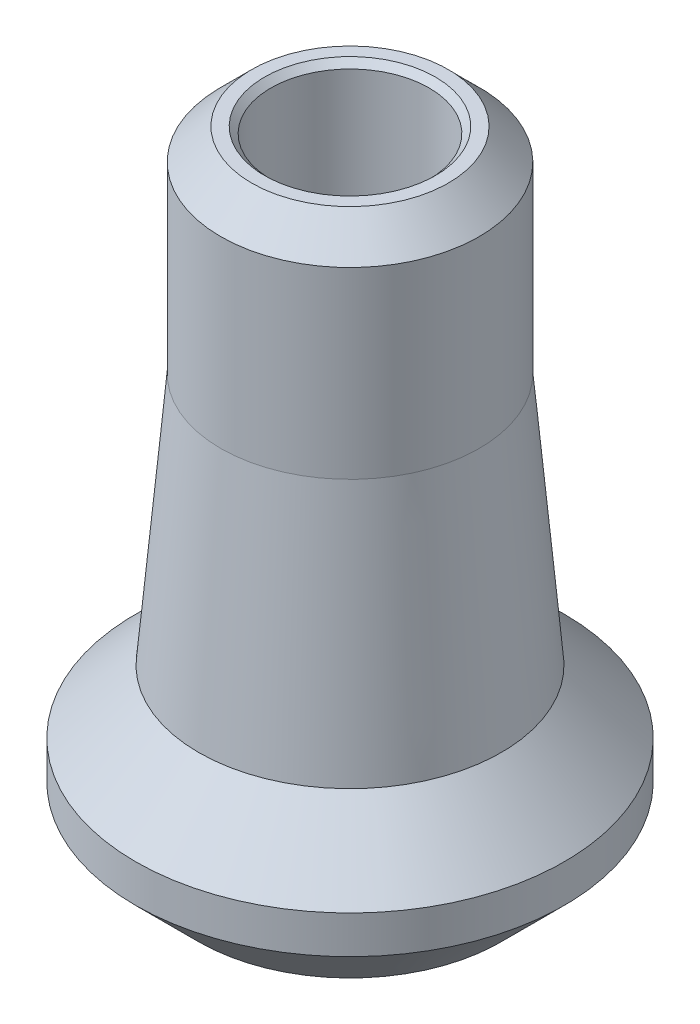
ISO-10303-21;
HEADER;
FILE_DESCRIPTION(('STEP AP214'),'2;1');
FILE_NAME('part.step','',(''),(''),'','','');
FILE_SCHEMA(('AUTOMOTIVE_DESIGN { 1 0 10303 214 1 1 1 1 }'));
ENDSEC;
DATA;
#1=APPLICATION_CONTEXT('core data for automotive mechanical design processes');
#2=APPLICATION_PROTOCOL_DEFINITION('international standard','automotive_design',2000,#1);
#3=PRODUCT_CONTEXT('',#1,'mechanical');
#4=PRODUCT('Part','Part','',(#3));
#5=PRODUCT_RELATED_PRODUCT_CATEGORY('part','',(#4));
#6=PRODUCT_DEFINITION_FORMATION('','',#4);
#7=PRODUCT_DEFINITION_CONTEXT('part definition',#1,'design');
#8=PRODUCT_DEFINITION('design','',#6,#7);
#9=PRODUCT_DEFINITION_SHAPE('','',#8);
#10=(LENGTH_UNIT() NAMED_UNIT(*) SI_UNIT(.MILLI.,.METRE.));
#11=(NAMED_UNIT(*) PLANE_ANGLE_UNIT() SI_UNIT($,.RADIAN.));
#12=(NAMED_UNIT(*) SI_UNIT($,.STERADIAN.) SOLID_ANGLE_UNIT());
#13=UNCERTAINTY_MEASURE_WITH_UNIT(LENGTH_MEASURE(1.E-05),#10,'distance_accuracy_value','');
#14=(GEOMETRIC_REPRESENTATION_CONTEXT(3) GLOBAL_UNCERTAINTY_ASSIGNED_CONTEXT((#13)) GLOBAL_UNIT_ASSIGNED_CONTEXT((#10,
#11,#12)) REPRESENTATION_CONTEXT('',''));
#15=CARTESIAN_POINT('',(0.,0.,0.));
#16=DIRECTION('',(0.,0.,1.));
#17=DIRECTION('',(1.,0.,0.));
#18=AXIS2_PLACEMENT_3D('',#15,#16,#17);
#19=CARTESIAN_POINT('',(0.,0.,0.));
#20=DIRECTION('',(0.,-1.,0.));
#21=DIRECTION('',(0.,0.,-1.));
#22=AXIS2_PLACEMENT_3D('',#19,#20,#21);
#23=CONICAL_SURFACE('',#22,3.9624,0.785398163397446);
#24=CARTESIAN_POINT('',(0.,-1.2446,0.));
#25=DIRECTION('',(0.,1.,0.));
#26=DIRECTION('',(0.,0.,1.));
#27=AXIS2_PLACEMENT_3D('',#24,#25,#26);
#28=CIRCLE('',#27,5.20699999999999);
#29=CARTESIAN_POINT('',(0.,-1.2446,5.20699999999999));
#30=VERTEX_POINT('',#29);
#31=EDGE_CURVE('E51',#30,#30,#28,.T.);
#32=ORIENTED_EDGE('',*,*,#31,.T.);
#33=EDGE_LOOP('',(#32));
#34=FACE_BOUND('',#33,.T.);
#35=CARTESIAN_POINT('',(0.,0.,0.));
#36=DIRECTION('',(0.,1.,0.));
#37=DIRECTION('',(0.,0.,1.));
#38=AXIS2_PLACEMENT_3D('',#35,#36,#37);
#39=CIRCLE('',#38,3.9624);
#40=CARTESIAN_POINT('',(0.,0.,3.9624));
#41=VERTEX_POINT('',#40);
#42=EDGE_CURVE('E69',#41,#41,#39,.T.);
#43=ORIENTED_EDGE('',*,*,#42,.F.);
#44=EDGE_LOOP('',(#43));
#45=FACE_BOUND('',#44,.T.);
#46=ADVANCED_FACE('F32',(#34,#45),#23,.T.);
#47=CARTESIAN_POINT('',(0.,0.,0.));
#48=DIRECTION('',(0.,1.,0.));
#49=DIRECTION('',(0.,0.,1.));
#50=AXIS2_PLACEMENT_3D('',#47,#48,#49);
#51=CYLINDRICAL_SURFACE('',#50,5.207);
#52=CARTESIAN_POINT('',(0.,-8.6346835028455,0.));
#53=DIRECTION('',(0.,1.,0.));
#54=DIRECTION('',(0.,0.,1.));
#55=AXIS2_PLACEMENT_3D('',#52,#53,#54);
#56=CIRCLE('',#55,5.207);
#57=CARTESIAN_POINT('',(0.,-8.6346835028455,5.207));
#58=VERTEX_POINT('',#57);
#59=EDGE_CURVE('E54',#58,#58,#56,.T.);
#60=ORIENTED_EDGE('',*,*,#59,.T.);
#61=EDGE_LOOP('',(#60));
#62=FACE_BOUND('',#61,.T.);
#63=ORIENTED_EDGE('',*,*,#31,.F.);
#64=EDGE_LOOP('',(#63));
#65=FACE_BOUND('',#64,.T.);
#66=ADVANCED_FACE('F76',(#62,#65),#51,.T.);
#67=CARTESIAN_POINT('',(0.,-8.6346835028455,0.));
#68=DIRECTION('',(0.,-1.,0.));
#69=DIRECTION('',(0.,0.,-1.));
#70=AXIS2_PLACEMENT_3D('',#67,#68,#69);
#71=CONICAL_SURFACE('',#70,5.207,0.0872664625997164);
#72=CARTESIAN_POINT('',(0.,-18.796,0.));
#73=DIRECTION('',(0.,1.,0.));
#74=DIRECTION('',(0.,0.,1.));
#75=AXIS2_PLACEMENT_3D('',#72,#73,#74);
#76=CIRCLE('',#75,6.09599999999997);
#77=CARTESIAN_POINT('',(0.,-18.796,6.09599999999997));
#78=VERTEX_POINT('',#77);
#79=EDGE_CURVE('E57',#78,#78,#76,.T.);
#80=ORIENTED_EDGE('',*,*,#79,.T.);
#81=EDGE_LOOP('',(#80));
#82=FACE_BOUND('',#81,.T.);
#83=ORIENTED_EDGE('',*,*,#59,.F.);
#84=EDGE_LOOP('',(#83));
#85=FACE_BOUND('',#84,.T.);
#86=ADVANCED_FACE('F81',(#82,#85),#71,.T.);
#87=CARTESIAN_POINT('',(0.,-18.796,0.));
#88=DIRECTION('',(0.,-1.,0.));
#89=DIRECTION('',(0.,0.,-1.));
#90=AXIS2_PLACEMENT_3D('',#87,#88,#89);
#91=CONICAL_SURFACE('',#90,6.09599999999997,0.785398163397453);
#92=CARTESIAN_POINT('',(0.,-21.336,0.));
#93=DIRECTION('',(0.,1.,0.));
#94=DIRECTION('',(0.,0.,1.));
#95=AXIS2_PLACEMENT_3D('',#92,#93,#94);
#96=CIRCLE('',#95,8.636);
#97=CARTESIAN_POINT('',(0.,-21.336,8.636));
#98=VERTEX_POINT('',#97);
#99=EDGE_CURVE('E60',#98,#98,#96,.T.);
#100=ORIENTED_EDGE('',*,*,#99,.T.);
#101=EDGE_LOOP('',(#100));
#102=FACE_BOUND('',#101,.T.);
#103=ORIENTED_EDGE('',*,*,#79,.F.);
#104=EDGE_LOOP('',(#103));
#105=FACE_BOUND('',#104,.T.);
#106=ADVANCED_FACE('F88',(#102,#105),#91,.T.);
#107=CARTESIAN_POINT('',(0.,0.,0.));
#108=DIRECTION('',(0.,1.,0.));
#109=DIRECTION('',(0.,0.,1.));
#110=AXIS2_PLACEMENT_3D('',#107,#108,#109);
#111=CYLINDRICAL_SURFACE('',#110,8.636);
#112=CARTESIAN_POINT('',(0.,-22.86,0.));
#113=DIRECTION('',(0.,1.,0.));
#114=DIRECTION('',(0.,0.,1.));
#115=AXIS2_PLACEMENT_3D('',#112,#113,#114);
#116=CIRCLE('',#115,8.636);
#117=CARTESIAN_POINT('',(0.,-22.86,8.636));
#118=VERTEX_POINT('',#117);
#119=EDGE_CURVE('E63',#118,#118,#116,.T.);
#120=ORIENTED_EDGE('',*,*,#119,.T.);
#121=EDGE_LOOP('',(#120));
#122=FACE_BOUND('',#121,.T.);
#123=ORIENTED_EDGE('',*,*,#99,.F.);
#124=EDGE_LOOP('',(#123));
#125=FACE_BOUND('',#124,.T.);
#126=ADVANCED_FACE('F94',(#122,#125),#111,.T.);
#127=CARTESIAN_POINT('',(0.,-22.86,0.));
#128=DIRECTION('',(0.,1.,0.));
#129=DIRECTION('',(0.,0.,1.));
#130=AXIS2_PLACEMENT_3D('',#127,#128,#129);
#131=CONICAL_SURFACE('',#130,8.636,0.785398163397447);
#132=CARTESIAN_POINT('',(0.,-25.4,0.));
#133=DIRECTION('',(0.,1.,0.));
#134=DIRECTION('',(0.,0.,1.));
#135=AXIS2_PLACEMENT_3D('',#132,#133,#134);
#136=CIRCLE('',#135,6.096);
#137=CARTESIAN_POINT('',(0.,-25.4,6.096));
#138=VERTEX_POINT('',#137);
#139=EDGE_CURVE('E66',#138,#138,#136,.T.);
#140=ORIENTED_EDGE('',*,*,#139,.T.);
#141=EDGE_LOOP('',(#140));
#142=FACE_BOUND('',#141,.T.);
#143=ORIENTED_EDGE('',*,*,#119,.F.);
#144=EDGE_LOOP('',(#143));
#145=FACE_BOUND('',#144,.T.);
#146=ADVANCED_FACE('F98',(#142,#145),#131,.T.);
#147=CARTESIAN_POINT('',(-3.42016915055214,-25.4,0.));
#148=DIRECTION('',(0.,-1.,0.));
#149=DIRECTION('',(0.,0.,-1.));
#150=AXIS2_PLACEMENT_3D('',#147,#148,#149);
#151=PLANE('',#150);
#152=CARTESIAN_POINT('',(0.,-25.4,0.));
#153=DIRECTION('',(0.,-1.,0.));
#154=DIRECTION('',(0.,0.,-1.));
#155=AXIS2_PLACEMENT_3D('',#152,#153,#154);
#156=CIRCLE('',#155,3.4417);
#157=CARTESIAN_POINT('',(0.,-25.4,-3.4417));
#158=VERTEX_POINT('',#157);
#159=EDGE_CURVE('E10',#158,#158,#156,.F.);
#160=ORIENTED_EDGE('',*,*,#159,.T.);
#161=EDGE_LOOP('',(#160));
#162=FACE_BOUND('',#161,.T.);
#163=ORIENTED_EDGE('',*,*,#139,.F.);
#164=EDGE_LOOP('',(#163));
#165=FACE_BOUND('',#164,.T.);
#166=ADVANCED_FACE('F102',(#162,#165),#151,.T.);
#167=CARTESIAN_POINT('',(0.,0.,0.));
#168=DIRECTION('',(0.,1.,0.));
#169=DIRECTION('',(0.,0.,1.));
#170=AXIS2_PLACEMENT_3D('',#167,#168,#169);
#171=CYLINDRICAL_SURFACE('',#170,3.1877);
#172=CARTESIAN_POINT('',(0.,-0.254000000000004,0.));
#173=DIRECTION('',(0.,-1.,0.));
#174=DIRECTION('',(0.,0.,-1.));
#175=AXIS2_PLACEMENT_3D('',#172,#173,#174);
#176=CIRCLE('',#175,3.1877);
#177=CARTESIAN_POINT('',(0.,-0.254000000000004,-3.1877));
#178=VERTEX_POINT('',#177);
#179=EDGE_CURVE('E42',#178,#178,#176,.F.);
#180=ORIENTED_EDGE('',*,*,#179,.T.);
#181=EDGE_LOOP('',(#180));
#182=FACE_BOUND('',#181,.T.);
#183=CARTESIAN_POINT('',(0.,-25.146,0.));
#184=DIRECTION('',(0.,-1.,0.));
#185=DIRECTION('',(0.,0.,-1.));
#186=AXIS2_PLACEMENT_3D('',#183,#184,#185);
#187=CIRCLE('',#186,3.1877);
#188=CARTESIAN_POINT('',(0.,-25.146,-3.1877));
#189=VERTEX_POINT('',#188);
#190=EDGE_CURVE('E46',#189,#189,#187,.T.);
#191=ORIENTED_EDGE('',*,*,#190,.T.);
#192=EDGE_LOOP('',(#191));
#193=FACE_BOUND('',#192,.T.);
#194=ADVANCED_FACE('F106',(#182,#193),#171,.F.);
#195=CARTESIAN_POINT('',(-3.42016915055214,0.,0.));
#196=DIRECTION('',(0.,-1.,0.));
#197=DIRECTION('',(0.,0.,-1.));
#198=AXIS2_PLACEMENT_3D('',#195,#196,#197);
#199=PLANE('',#198);
#200=CARTESIAN_POINT('',(0.,0.,0.));
#201=DIRECTION('',(0.,-1.,0.));
#202=DIRECTION('',(0.,0.,-1.));
#203=AXIS2_PLACEMENT_3D('',#200,#201,#202);
#204=CIRCLE('',#203,3.4417);
#205=CARTESIAN_POINT('',(0.,0.,-3.4417));
#206=VERTEX_POINT('',#205);
#207=EDGE_CURVE('E38',#206,#206,#204,.T.);
#208=ORIENTED_EDGE('',*,*,#207,.T.);
#209=EDGE_LOOP('',(#208));
#210=FACE_BOUND('',#209,.T.);
#211=ORIENTED_EDGE('',*,*,#42,.T.);
#212=EDGE_LOOP('',(#211));
#213=FACE_BOUND('',#212,.T.);
#214=ADVANCED_FACE('F73',(#210,#213),#199,.F.);
#215=CARTESIAN_POINT('',(0.,-0.254000000000004,0.));
#216=DIRECTION('',(0.,1.,0.));
#217=DIRECTION('',(0.,0.,1.));
#218=AXIS2_PLACEMENT_3D('',#215,#216,#217);
#219=CONICAL_SURFACE('',#218,3.1877,0.785398163397448);
#220=ORIENTED_EDGE('',*,*,#207,.F.);
#221=EDGE_LOOP('',(#220));
#222=FACE_BOUND('',#221,.T.);
#223=ORIENTED_EDGE('',*,*,#179,.F.);
#224=EDGE_LOOP('',(#223));
#225=FACE_BOUND('',#224,.T.);
#226=ADVANCED_FACE('F112',(#222,#225),#219,.F.);
#227=CARTESIAN_POINT('',(0.,-25.4,0.));
#228=DIRECTION('',(0.,-1.,0.));
#229=DIRECTION('',(0.,0.,-1.));
#230=AXIS2_PLACEMENT_3D('',#227,#228,#229);
#231=CONICAL_SURFACE('',#230,3.4417,0.78539816339745);
#232=ORIENTED_EDGE('',*,*,#190,.F.);
#233=EDGE_LOOP('',(#232));
#234=FACE_BOUND('',#233,.T.);
#235=ORIENTED_EDGE('',*,*,#159,.F.);
#236=EDGE_LOOP('',(#235));
#237=FACE_BOUND('',#236,.T.);
#238=ADVANCED_FACE('F115',(#234,#237),#231,.F.);
#239=CLOSED_SHELL('',(#46,#66,#86,#106,#126,#146,#166,#194,#214,#226,#238));
#240=MANIFOLD_SOLID_BREP('B2',#239);
#241=ADVANCED_BREP_SHAPE_REPRESENTATION('',(#18,#240),#14);
#242=SHAPE_DEFINITION_REPRESENTATION(#9,#241);
ENDSEC;
END-ISO-10303-21;
